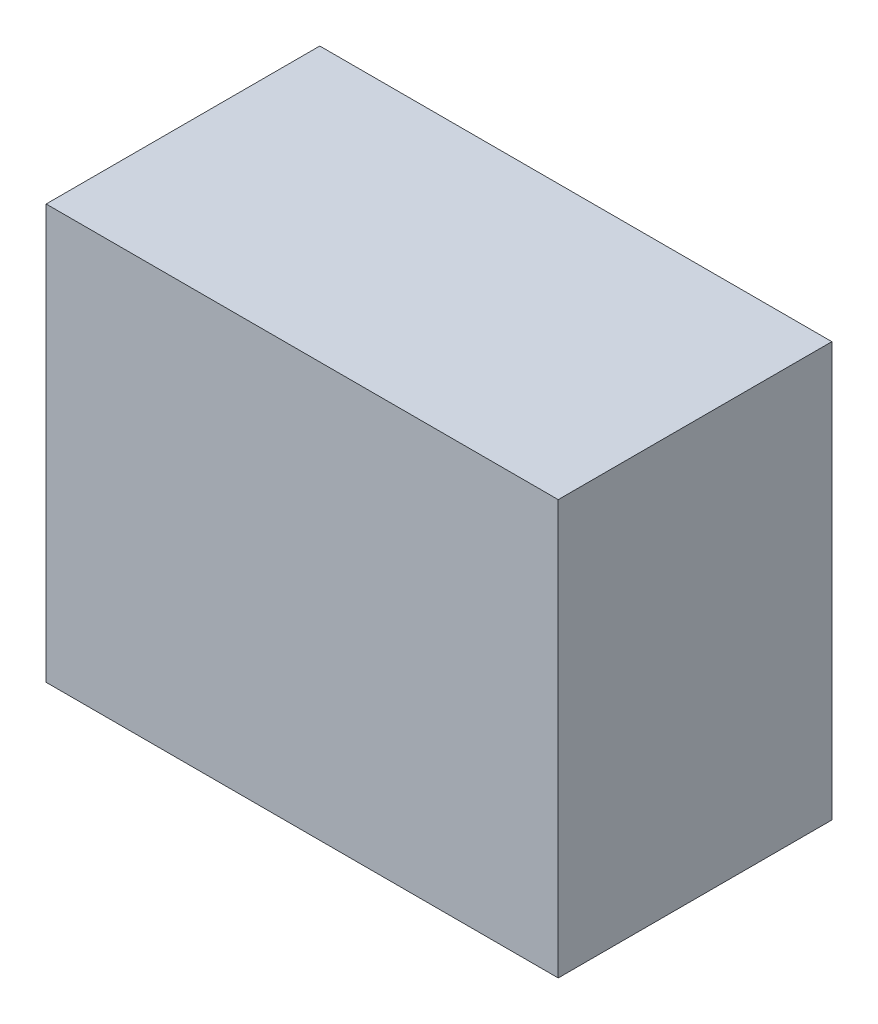
ISO-10303-21;
HEADER;
FILE_DESCRIPTION(('STEP AP214'),'2;1');
FILE_NAME('part.step','',(''),(''),'','','');
FILE_SCHEMA(('AUTOMOTIVE_DESIGN { 1 0 10303 214 1 1 1 1 }'));
ENDSEC;
DATA;
#1=APPLICATION_CONTEXT('core data for automotive mechanical design processes');
#2=APPLICATION_PROTOCOL_DEFINITION('international standard','automotive_design',2000,#1);
#3=PRODUCT_CONTEXT('',#1,'mechanical');
#4=PRODUCT('Part','Part','',(#3));
#5=PRODUCT_RELATED_PRODUCT_CATEGORY('part','',(#4));
#6=PRODUCT_DEFINITION_FORMATION('','',#4);
#7=PRODUCT_DEFINITION_CONTEXT('part definition',#1,'design');
#8=PRODUCT_DEFINITION('design','',#6,#7);
#9=PRODUCT_DEFINITION_SHAPE('','',#8);
#10=(LENGTH_UNIT() NAMED_UNIT(*) SI_UNIT(.MILLI.,.METRE.));
#11=(NAMED_UNIT(*) PLANE_ANGLE_UNIT() SI_UNIT($,.RADIAN.));
#12=(NAMED_UNIT(*) SI_UNIT($,.STERADIAN.) SOLID_ANGLE_UNIT());
#13=UNCERTAINTY_MEASURE_WITH_UNIT(LENGTH_MEASURE(1.E-05),#10,'distance_accuracy_value','');
#14=(GEOMETRIC_REPRESENTATION_CONTEXT(3) GLOBAL_UNCERTAINTY_ASSIGNED_CONTEXT((#13)) GLOBAL_UNIT_ASSIGNED_CONTEXT((#10,
#11,#12)) REPRESENTATION_CONTEXT('',''));
#15=CARTESIAN_POINT('',(0.,0.,0.));
#16=DIRECTION('',(0.,0.,1.));
#17=DIRECTION('',(1.,0.,0.));
#18=AXIS2_PLACEMENT_3D('',#15,#16,#17);
#19=CARTESIAN_POINT('',(-23.3,-18.85,24.9));
#20=DIRECTION('',(1.,0.,0.));
#21=DIRECTION('',(0.,0.,-1.));
#22=AXIS2_PLACEMENT_3D('',#19,#20,#21);
#23=PLANE('',#22);
#24=DIRECTION('',(0.,-1.,0.));
#25=VECTOR('',#24,1.);
#26=CARTESIAN_POINT('',(-23.3,-18.85,0.));
#27=LINE('',#26,#25);
#28=CARTESIAN_POINT('',(-23.3,18.85,0.));
#29=VERTEX_POINT('',#28);
#30=CARTESIAN_POINT('',(-23.3,-18.85,0.));
#31=VERTEX_POINT('',#30);
#32=EDGE_CURVE('E113',#29,#31,#27,.T.);
#33=ORIENTED_EDGE('',*,*,#32,.T.);
#34=DIRECTION('',(0.,0.,-1.));
#35=VECTOR('',#34,1.);
#36=CARTESIAN_POINT('',(-23.3,-18.85,24.9));
#37=LINE('',#36,#35);
#38=CARTESIAN_POINT('',(-23.3,-18.85,24.9));
#39=VERTEX_POINT('',#38);
#40=EDGE_CURVE('E11',#39,#31,#37,.T.);
#41=ORIENTED_EDGE('',*,*,#40,.F.);
#42=DIRECTION('',(0.,-1.,0.));
#43=VECTOR('',#42,1.);
#44=CARTESIAN_POINT('',(-23.3,-18.85,24.9));
#45=LINE('',#44,#43);
#46=CARTESIAN_POINT('',(-23.3,18.85,24.9));
#47=VERTEX_POINT('',#46);
#48=EDGE_CURVE('E97',#47,#39,#45,.T.);
#49=ORIENTED_EDGE('',*,*,#48,.F.);
#50=DIRECTION('',(0.,0.,-1.));
#51=VECTOR('',#50,1.);
#52=CARTESIAN_POINT('',(-23.3,18.85,24.9));
#53=LINE('',#52,#51);
#54=EDGE_CURVE('E109',#47,#29,#53,.T.);
#55=ORIENTED_EDGE('',*,*,#54,.T.);
#56=EDGE_LOOP('',(#33,#41,#49,#55));
#57=FACE_BOUND('',#56,.T.);
#58=ADVANCED_FACE('F45',(#57),#23,.F.);
#59=CARTESIAN_POINT('',(23.3,-18.85,24.9));
#60=DIRECTION('',(0.,1.,0.));
#61=DIRECTION('',(-1.,0.,0.));
#62=AXIS2_PLACEMENT_3D('',#59,#60,#61);
#63=PLANE('',#62);
#64=DIRECTION('',(1.,0.,0.));
#65=VECTOR('',#64,1.);
#66=CARTESIAN_POINT('',(23.3,-18.85,0.));
#67=LINE('',#66,#65);
#68=CARTESIAN_POINT('',(23.3,-18.85,0.));
#69=VERTEX_POINT('',#68);
#70=EDGE_CURVE('E102',#31,#69,#67,.T.);
#71=ORIENTED_EDGE('',*,*,#70,.T.);
#72=DIRECTION('',(0.,0.,-1.));
#73=VECTOR('',#72,1.);
#74=CARTESIAN_POINT('',(23.3,-18.85,24.9));
#75=LINE('',#74,#73);
#76=CARTESIAN_POINT('',(23.3,-18.85,24.9));
#77=VERTEX_POINT('',#76);
#78=EDGE_CURVE('E54',#77,#69,#75,.T.);
#79=ORIENTED_EDGE('',*,*,#78,.F.);
#80=DIRECTION('',(1.,0.,0.));
#81=VECTOR('',#80,1.);
#82=CARTESIAN_POINT('',(23.3,-18.85,24.9));
#83=LINE('',#82,#81);
#84=EDGE_CURVE('E92',#39,#77,#83,.T.);
#85=ORIENTED_EDGE('',*,*,#84,.F.);
#86=ORIENTED_EDGE('',*,*,#40,.T.);
#87=EDGE_LOOP('',(#71,#79,#85,#86));
#88=FACE_BOUND('',#87,.T.);
#89=ADVANCED_FACE('F101',(#88),#63,.F.);
#90=CARTESIAN_POINT('',(23.3,-18.85,24.9));
#91=DIRECTION('',(-1.,0.,0.));
#92=DIRECTION('',(0.,0.,1.));
#93=AXIS2_PLACEMENT_3D('',#90,#91,#92);
#94=PLANE('',#93);
#95=DIRECTION('',(0.,1.,0.));
#96=VECTOR('',#95,1.);
#97=CARTESIAN_POINT('',(23.3,-18.85,0.));
#98=LINE('',#97,#96);
#99=CARTESIAN_POINT('',(23.3,18.85,0.));
#100=VERTEX_POINT('',#99);
#101=EDGE_CURVE('E79',#69,#100,#98,.T.);
#102=ORIENTED_EDGE('',*,*,#101,.T.);
#103=DIRECTION('',(0.,0.,-1.));
#104=VECTOR('',#103,1.);
#105=CARTESIAN_POINT('',(23.3,18.85,24.9));
#106=LINE('',#105,#104);
#107=CARTESIAN_POINT('',(23.3,18.85,24.9));
#108=VERTEX_POINT('',#107);
#109=EDGE_CURVE('E104',#108,#100,#106,.T.);
#110=ORIENTED_EDGE('',*,*,#109,.F.);
#111=DIRECTION('',(0.,1.,0.));
#112=VECTOR('',#111,1.);
#113=CARTESIAN_POINT('',(23.3,-18.85,24.9));
#114=LINE('',#113,#112);
#115=EDGE_CURVE('E95',#77,#108,#114,.T.);
#116=ORIENTED_EDGE('',*,*,#115,.F.);
#117=ORIENTED_EDGE('',*,*,#78,.T.);
#118=EDGE_LOOP('',(#102,#110,#116,#117));
#119=FACE_BOUND('',#118,.T.);
#120=ADVANCED_FACE('F105',(#119),#94,.F.);
#121=CARTESIAN_POINT('',(23.3,18.85,24.9));
#122=DIRECTION('',(0.,-1.,0.));
#123=DIRECTION('',(1.,0.,0.));
#124=AXIS2_PLACEMENT_3D('',#121,#122,#123);
#125=PLANE('',#124);
#126=DIRECTION('',(-1.,0.,0.));
#127=VECTOR('',#126,1.);
#128=CARTESIAN_POINT('',(23.3,18.85,0.));
#129=LINE('',#128,#127);
#130=EDGE_CURVE('E85',#100,#29,#129,.T.);
#131=ORIENTED_EDGE('',*,*,#130,.T.);
#132=ORIENTED_EDGE('',*,*,#54,.F.);
#133=DIRECTION('',(-1.,0.,0.));
#134=VECTOR('',#133,1.);
#135=CARTESIAN_POINT('',(23.3,18.85,24.9));
#136=LINE('',#135,#134);
#137=EDGE_CURVE('E62',#108,#47,#136,.T.);
#138=ORIENTED_EDGE('',*,*,#137,.F.);
#139=ORIENTED_EDGE('',*,*,#109,.T.);
#140=EDGE_LOOP('',(#131,#132,#138,#139));
#141=FACE_BOUND('',#140,.T.);
#142=ADVANCED_FACE('F126',(#141),#125,.F.);
#143=CARTESIAN_POINT('',(0.,0.,24.9));
#144=DIRECTION('',(0.,0.,1.));
#145=DIRECTION('',(1.,0.,0.));
#146=AXIS2_PLACEMENT_3D('',#143,#144,#145);
#147=PLANE('',#146);
#148=ORIENTED_EDGE('',*,*,#48,.T.);
#149=ORIENTED_EDGE('',*,*,#84,.T.);
#150=ORIENTED_EDGE('',*,*,#115,.T.);
#151=ORIENTED_EDGE('',*,*,#137,.T.);
#152=EDGE_LOOP('',(#148,#149,#150,#151));
#153=FACE_BOUND('',#152,.T.);
#154=ADVANCED_FACE('F93',(#153),#147,.T.);
#155=CARTESIAN_POINT('',(0.,0.,0.));
#156=DIRECTION('',(0.,0.,1.));
#157=DIRECTION('',(1.,0.,0.));
#158=AXIS2_PLACEMENT_3D('',#155,#156,#157);
#159=PLANE('',#158);
#160=ORIENTED_EDGE('',*,*,#32,.F.);
#161=ORIENTED_EDGE('',*,*,#130,.F.);
#162=ORIENTED_EDGE('',*,*,#101,.F.);
#163=ORIENTED_EDGE('',*,*,#70,.F.);
#164=EDGE_LOOP('',(#160,#161,#162,#163));
#165=FACE_BOUND('',#164,.T.);
#166=ADVANCED_FACE('F129',(#165),#159,.F.);
#167=CLOSED_SHELL('',(#58,#89,#120,#142,#154,#166));
#168=MANIFOLD_SOLID_BREP('B2',#167);
#169=ADVANCED_BREP_SHAPE_REPRESENTATION('',(#18,#168),#14);
#170=SHAPE_DEFINITION_REPRESENTATION(#9,#169);
ENDSEC;
END-ISO-10303-21;
